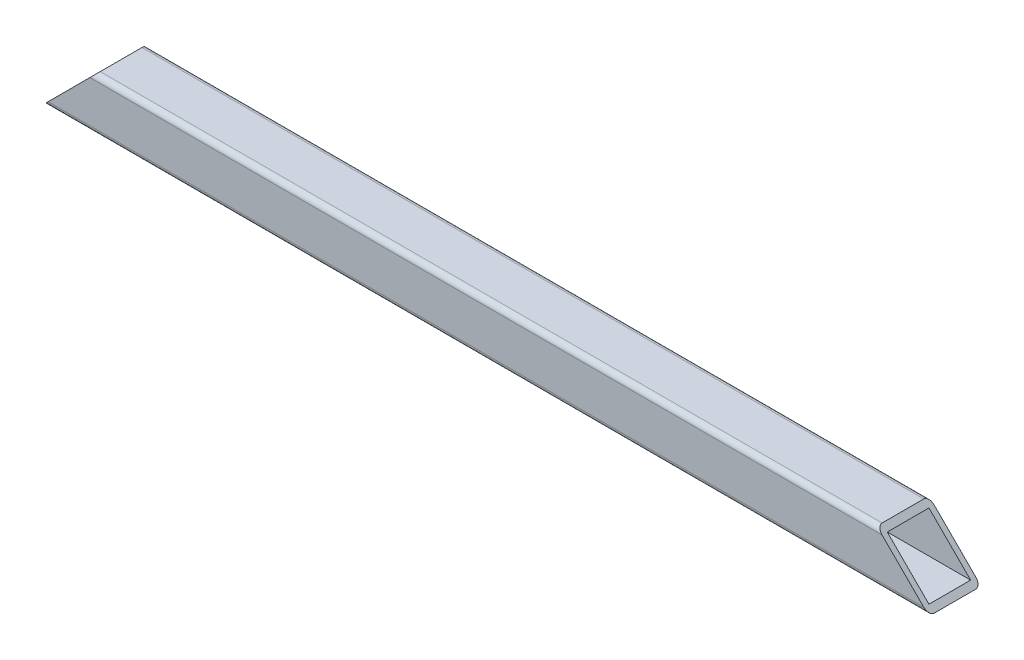
ISO-10303-21;
HEADER;
FILE_DESCRIPTION(('STEP AP214'),'2;1');
FILE_NAME('part.step','',(''),(''),'','','');
FILE_SCHEMA(('AUTOMOTIVE_DESIGN { 1 0 10303 214 1 1 1 1 }'));
ENDSEC;
DATA;
#1=APPLICATION_CONTEXT('core data for automotive mechanical design processes');
#2=APPLICATION_PROTOCOL_DEFINITION('international standard','automotive_design',2000,#1);
#3=PRODUCT_CONTEXT('',#1,'mechanical');
#4=PRODUCT('Part','Part','',(#3));
#5=PRODUCT_RELATED_PRODUCT_CATEGORY('part','',(#4));
#6=PRODUCT_DEFINITION_FORMATION('','',#4);
#7=PRODUCT_DEFINITION_CONTEXT('part definition',#1,'design');
#8=PRODUCT_DEFINITION('design','',#6,#7);
#9=PRODUCT_DEFINITION_SHAPE('','',#8);
#10=(LENGTH_UNIT() NAMED_UNIT(*) SI_UNIT(.MILLI.,.METRE.));
#11=(NAMED_UNIT(*) PLANE_ANGLE_UNIT() SI_UNIT($,.RADIAN.));
#12=(NAMED_UNIT(*) SI_UNIT($,.STERADIAN.) SOLID_ANGLE_UNIT());
#13=UNCERTAINTY_MEASURE_WITH_UNIT(LENGTH_MEASURE(1.E-05),#10,'distance_accuracy_value','');
#14=(GEOMETRIC_REPRESENTATION_CONTEXT(3) GLOBAL_UNCERTAINTY_ASSIGNED_CONTEXT((#13)) GLOBAL_UNIT_ASSIGNED_CONTEXT((#10,
#11,#12)) REPRESENTATION_CONTEXT('',''));
#15=CARTESIAN_POINT('',(0.,0.,0.));
#16=DIRECTION('',(0.,0.,1.));
#17=DIRECTION('',(1.,0.,0.));
#18=AXIS2_PLACEMENT_3D('',#15,#16,#17);
#19=CARTESIAN_POINT('',(-269.900000000001,-1100.,-20.));
#20=DIRECTION('',(0.,-1.,0.));
#21=DIRECTION('',(0.,0.,-1.));
#22=AXIS2_PLACEMENT_3D('',#19,#20,#21);
#23=PLANE('',#22);
#24=DIRECTION('',(0.,0.,1.));
#25=VECTOR('',#24,1.);
#26=CARTESIAN_POINT('',(-610.100000000001,-1100.,-20.));
#27=LINE('',#26,#25);
#28=CARTESIAN_POINT('',(-610.100000000001,-1100.,-18.));
#29=VERTEX_POINT('',#28);
#30=CARTESIAN_POINT('',(-610.100000000001,-1100.,-2.));
#31=VERTEX_POINT('',#30);
#32=EDGE_CURVE('E197',#29,#31,#27,.T.);
#33=ORIENTED_EDGE('',*,*,#32,.F.);
#34=DIRECTION('',(1.,0.,0.));
#35=VECTOR('',#34,1.);
#36=CARTESIAN_POINT('',(-269.900000000001,-1100.,-18.));
#37=LINE('',#36,#35);
#38=CARTESIAN_POINT('',(-269.900000000001,-1100.,-18.));
#39=VERTEX_POINT('',#38);
#40=EDGE_CURVE('E224',#29,#39,#37,.T.);
#41=ORIENTED_EDGE('',*,*,#40,.T.);
#42=DIRECTION('',(0.,0.,1.));
#43=VECTOR('',#42,1.);
#44=CARTESIAN_POINT('',(-269.900000000001,-1100.,-20.));
#45=LINE('',#44,#43);
#46=CARTESIAN_POINT('',(-269.900000000001,-1100.,-2.));
#47=VERTEX_POINT('',#46);
#48=EDGE_CURVE('E198',#39,#47,#45,.T.);
#49=ORIENTED_EDGE('',*,*,#48,.T.);
#50=DIRECTION('',(1.,0.,0.));
#51=VECTOR('',#50,1.);
#52=CARTESIAN_POINT('',(-269.900000000001,-1100.,-2.));
#53=LINE('',#52,#51);
#54=EDGE_CURVE('E220',#47,#31,#53,.F.);
#55=ORIENTED_EDGE('',*,*,#54,.T.);
#56=EDGE_LOOP('',(#33,#41,#49,#55));
#57=FACE_BOUND('',#56,.T.);
#58=ADVANCED_FACE('F44',(#57),#23,.T.);
#59=CARTESIAN_POINT('',(-269.900000000001,-1080.,-20.));
#60=DIRECTION('',(0.,1.,0.));
#61=DIRECTION('',(0.,0.,1.));
#62=AXIS2_PLACEMENT_3D('',#59,#60,#61);
#63=PLANE('',#62);
#64=DIRECTION('',(0.,0.,1.));
#65=VECTOR('',#64,1.);
#66=CARTESIAN_POINT('',(-289.900000000001,-1080.,-20.));
#67=LINE('',#66,#65);
#68=CARTESIAN_POINT('',(-289.900000000001,-1080.,-18.));
#69=VERTEX_POINT('',#68);
#70=CARTESIAN_POINT('',(-289.900000000001,-1080.,-2.));
#71=VERTEX_POINT('',#70);
#72=EDGE_CURVE('E166',#69,#71,#67,.T.);
#73=ORIENTED_EDGE('',*,*,#72,.F.);
#74=DIRECTION('',(-1.,0.,0.));
#75=VECTOR('',#74,1.);
#76=CARTESIAN_POINT('',(-610.100000000001,-1080.,-18.));
#77=LINE('',#76,#75);
#78=CARTESIAN_POINT('',(-590.100000000001,-1080.,-18.));
#79=VERTEX_POINT('',#78);
#80=EDGE_CURVE('E208',#69,#79,#77,.T.);
#81=ORIENTED_EDGE('',*,*,#80,.T.);
#82=DIRECTION('',(0.,0.,1.));
#83=VECTOR('',#82,1.);
#84=CARTESIAN_POINT('',(-590.100000000001,-1080.,-20.));
#85=LINE('',#84,#83);
#86=CARTESIAN_POINT('',(-590.100000000001,-1080.,-2.));
#87=VERTEX_POINT('',#86);
#88=EDGE_CURVE('E170',#79,#87,#85,.T.);
#89=ORIENTED_EDGE('',*,*,#88,.T.);
#90=DIRECTION('',(-1.,0.,0.));
#91=VECTOR('',#90,1.);
#92=CARTESIAN_POINT('',(-269.900000000001,-1080.,-2.));
#93=LINE('',#92,#91);
#94=EDGE_CURVE('E202',#87,#71,#93,.F.);
#95=ORIENTED_EDGE('',*,*,#94,.T.);
#96=EDGE_LOOP('',(#73,#81,#89,#95));
#97=FACE_BOUND('',#96,.T.);
#98=ADVANCED_FACE('F276',(#97),#63,.T.);
#99=CARTESIAN_POINT('',(0.,0.,-20.));
#100=DIRECTION('',(0.,0.,1.));
#101=DIRECTION('',(1.,0.,0.));
#102=AXIS2_PLACEMENT_3D('',#99,#100,#101);
#103=PLANE('',#102);
#104=DIRECTION('',(-1.,0.,0.));
#105=VECTOR('',#104,1.);
#106=CARTESIAN_POINT('',(-269.900000000001,-1082.,-20.));
#107=LINE('',#106,#105);
#108=CARTESIAN_POINT('',(-592.100000000001,-1082.,-20.));
#109=VERTEX_POINT('',#108);
#110=CARTESIAN_POINT('',(-287.900000000001,-1082.,-20.));
#111=VERTEX_POINT('',#110);
#112=EDGE_CURVE('E216',#109,#111,#107,.F.);
#113=ORIENTED_EDGE('',*,*,#112,.T.);
#114=DIRECTION('',(0.707106781186544,-0.707106781186551,0.));
#115=VECTOR('',#114,1.);
#116=CARTESIAN_POINT('',(-289.900000000001,-1080.,-20.));
#117=LINE('',#116,#115);
#118=CARTESIAN_POINT('',(-271.900000000001,-1098.,-20.));
#119=VERTEX_POINT('',#118);
#120=EDGE_CURVE('E162',#111,#119,#117,.T.);
#121=ORIENTED_EDGE('',*,*,#120,.T.);
#122=DIRECTION('',(1.,0.,0.));
#123=VECTOR('',#122,1.);
#124=CARTESIAN_POINT('',(-610.100000000001,-1098.,-20.));
#125=LINE('',#124,#123);
#126=CARTESIAN_POINT('',(-608.100000000001,-1098.,-20.));
#127=VERTEX_POINT('',#126);
#128=EDGE_CURVE('E212',#119,#127,#125,.F.);
#129=ORIENTED_EDGE('',*,*,#128,.T.);
#130=DIRECTION('',(0.707106781186544,0.707106781186551,0.));
#131=VECTOR('',#130,1.);
#132=CARTESIAN_POINT('',(-610.100000000001,-1100.,-20.));
#133=LINE('',#132,#131);
#134=EDGE_CURVE('E157',#127,#109,#133,.T.);
#135=ORIENTED_EDGE('',*,*,#134,.T.);
#136=EDGE_LOOP('',(#113,#121,#129,#135));
#137=FACE_BOUND('',#136,.T.);
#138=ADVANCED_FACE('F282',(#137),#103,.F.);
#139=CARTESIAN_POINT('',(0.,0.,0.));
#140=DIRECTION('',(0.,0.,1.));
#141=DIRECTION('',(1.,0.,0.));
#142=AXIS2_PLACEMENT_3D('',#139,#140,#141);
#143=PLANE('',#142);
#144=DIRECTION('',(0.707106781186544,-0.707106781186551,0.));
#145=VECTOR('',#144,1.);
#146=CARTESIAN_POINT('',(-289.900000000001,-1080.,0.));
#147=LINE('',#146,#145);
#148=CARTESIAN_POINT('',(-287.900000000001,-1082.,0.));
#149=VERTEX_POINT('',#148);
#150=CARTESIAN_POINT('',(-271.900000000001,-1098.,0.));
#151=VERTEX_POINT('',#150);
#152=EDGE_CURVE('E167',#149,#151,#147,.T.);
#153=ORIENTED_EDGE('',*,*,#152,.F.);
#154=DIRECTION('',(-1.,0.,0.));
#155=VECTOR('',#154,1.);
#156=CARTESIAN_POINT('',(0.,-1082.,0.));
#157=LINE('',#156,#155);
#158=CARTESIAN_POINT('',(-592.100000000001,-1082.,0.));
#159=VERTEX_POINT('',#158);
#160=EDGE_CURVE('E232',#149,#159,#157,.T.);
#161=ORIENTED_EDGE('',*,*,#160,.T.);
#162=DIRECTION('',(0.707106781186544,0.707106781186551,0.));
#163=VECTOR('',#162,1.);
#164=CARTESIAN_POINT('',(-610.100000000001,-1100.,0.));
#165=LINE('',#164,#163);
#166=CARTESIAN_POINT('',(-608.100000000001,-1098.,0.));
#167=VERTEX_POINT('',#166);
#168=EDGE_CURVE('E153',#167,#159,#165,.T.);
#169=ORIENTED_EDGE('',*,*,#168,.F.);
#170=DIRECTION('',(1.,0.,0.));
#171=VECTOR('',#170,1.);
#172=CARTESIAN_POINT('',(0.,-1098.,0.));
#173=LINE('',#172,#171);
#174=EDGE_CURVE('E228',#167,#151,#173,.T.);
#175=ORIENTED_EDGE('',*,*,#174,.T.);
#176=EDGE_LOOP('',(#153,#161,#169,#175));
#177=FACE_BOUND('',#176,.T.);
#178=ADVANCED_FACE('F287',(#177),#143,.T.);
#179=CARTESIAN_POINT('',(-269.900000000001,-1082.,-18.));
#180=DIRECTION('',(1.,0.,0.));
#181=DIRECTION('',(0.,0.,-1.));
#182=AXIS2_PLACEMENT_3D('',#179,#180,#181);
#183=CYLINDRICAL_SURFACE('',#182,2.);
#184=CARTESIAN_POINT('',(-287.900000000001,-1082.,-18.));
#185=DIRECTION('',(-0.707106781186551,-0.707106781186544,0.));
#186=DIRECTION('',(0.707106781186544,-0.707106781186551,0.));
#187=AXIS2_PLACEMENT_3D('',#184,#185,#186);
#188=ELLIPSE('',#187,2.82842712474617,2.);
#189=EDGE_CURVE('E194',#111,#69,#188,.F.);
#190=ORIENTED_EDGE('',*,*,#189,.F.);
#191=ORIENTED_EDGE('',*,*,#112,.F.);
#192=CARTESIAN_POINT('',(-592.100000000001,-1082.,-18.));
#193=DIRECTION('',(0.707106781186551,-0.707106781186544,0.));
#194=DIRECTION('',(0.707106781186544,0.707106781186551,0.));
#195=AXIS2_PLACEMENT_3D('',#192,#193,#194);
#196=ELLIPSE('',#195,2.82842712474617,2.);
#197=EDGE_CURVE('E185',#79,#109,#196,.F.);
#198=ORIENTED_EDGE('',*,*,#197,.F.);
#199=ORIENTED_EDGE('',*,*,#80,.F.);
#200=EDGE_LOOP('',(#190,#191,#198,#199));
#201=FACE_BOUND('',#200,.T.);
#202=ADVANCED_FACE('F290',(#201),#183,.T.);
#203=CARTESIAN_POINT('',(-269.900000000001,-1098.,-18.));
#204=DIRECTION('',(-1.,0.,0.));
#205=DIRECTION('',(0.,0.,1.));
#206=AXIS2_PLACEMENT_3D('',#203,#204,#205);
#207=CYLINDRICAL_SURFACE('',#206,2.);
#208=CARTESIAN_POINT('',(-271.900000000001,-1098.,-18.));
#209=DIRECTION('',(-0.707106781186551,-0.707106781186544,0.));
#210=DIRECTION('',(-0.707106781186544,0.707106781186551,0.));
#211=AXIS2_PLACEMENT_3D('',#208,#209,#210);
#212=ELLIPSE('',#211,2.82842712474617,2.);
#213=EDGE_CURVE('E191',#39,#119,#212,.F.);
#214=ORIENTED_EDGE('',*,*,#213,.F.);
#215=ORIENTED_EDGE('',*,*,#40,.F.);
#216=CARTESIAN_POINT('',(-608.100000000001,-1098.,-18.));
#217=DIRECTION('',(0.707106781186551,-0.707106781186544,0.));
#218=DIRECTION('',(-0.707106781186544,-0.707106781186551,0.));
#219=AXIS2_PLACEMENT_3D('',#216,#217,#218);
#220=ELLIPSE('',#219,2.82842712474617,2.);
#221=EDGE_CURVE('E182',#127,#29,#220,.F.);
#222=ORIENTED_EDGE('',*,*,#221,.F.);
#223=ORIENTED_EDGE('',*,*,#128,.F.);
#224=EDGE_LOOP('',(#214,#215,#222,#223));
#225=FACE_BOUND('',#224,.T.);
#226=ADVANCED_FACE('F293',(#225),#207,.T.);
#227=CARTESIAN_POINT('',(0.,-1082.,-2.));
#228=DIRECTION('',(-1.,0.,0.));
#229=DIRECTION('',(0.,0.,1.));
#230=AXIS2_PLACEMENT_3D('',#227,#228,#229);
#231=CYLINDRICAL_SURFACE('',#230,2.);
#232=CARTESIAN_POINT('',(-287.900000000001,-1082.,-2.));
#233=DIRECTION('',(-0.707106781186551,-0.707106781186544,0.));
#234=DIRECTION('',(-0.707106781186544,0.707106781186551,0.));
#235=AXIS2_PLACEMENT_3D('',#232,#233,#234);
#236=ELLIPSE('',#235,2.82842712474617,2.);
#237=EDGE_CURVE('E188',#71,#149,#236,.F.);
#238=ORIENTED_EDGE('',*,*,#237,.F.);
#239=ORIENTED_EDGE('',*,*,#94,.F.);
#240=CARTESIAN_POINT('',(-592.100000000001,-1082.,-2.));
#241=DIRECTION('',(0.707106781186551,-0.707106781186544,0.));
#242=DIRECTION('',(-0.707106781186544,-0.707106781186551,0.));
#243=AXIS2_PLACEMENT_3D('',#240,#241,#242);
#244=ELLIPSE('',#243,2.82842712474617,2.);
#245=EDGE_CURVE('E173',#159,#87,#244,.F.);
#246=ORIENTED_EDGE('',*,*,#245,.F.);
#247=ORIENTED_EDGE('',*,*,#160,.F.);
#248=EDGE_LOOP('',(#238,#239,#246,#247));
#249=FACE_BOUND('',#248,.T.);
#250=ADVANCED_FACE('F296',(#249),#231,.T.);
#251=CARTESIAN_POINT('',(0.,-1098.,-2.));
#252=DIRECTION('',(1.,0.,0.));
#253=DIRECTION('',(0.,0.,-1.));
#254=AXIS2_PLACEMENT_3D('',#251,#252,#253);
#255=CYLINDRICAL_SURFACE('',#254,2.);
#256=CARTESIAN_POINT('',(-271.900000000001,-1098.,-2.));
#257=DIRECTION('',(-0.707106781186551,-0.707106781186544,0.));
#258=DIRECTION('',(0.707106781186544,-0.707106781186551,0.));
#259=AXIS2_PLACEMENT_3D('',#256,#257,#258);
#260=ELLIPSE('',#259,2.82842712474617,2.);
#261=EDGE_CURVE('E239',#151,#47,#260,.F.);
#262=ORIENTED_EDGE('',*,*,#261,.F.);
#263=ORIENTED_EDGE('',*,*,#174,.F.);
#264=CARTESIAN_POINT('',(-608.100000000001,-1098.,-2.));
#265=DIRECTION('',(0.707106781186551,-0.707106781186544,0.));
#266=DIRECTION('',(0.707106781186544,0.707106781186551,0.));
#267=AXIS2_PLACEMENT_3D('',#264,#265,#266);
#268=ELLIPSE('',#267,2.82842712474617,2.);
#269=EDGE_CURVE('E236',#31,#167,#268,.F.);
#270=ORIENTED_EDGE('',*,*,#269,.F.);
#271=ORIENTED_EDGE('',*,*,#54,.F.);
#272=EDGE_LOOP('',(#262,#263,#270,#271));
#273=FACE_BOUND('',#272,.T.);
#274=ADVANCED_FACE('F46',(#273),#255,.T.);
#275=CARTESIAN_POINT('',(-610.100000000001,-1100.,-20.));
#276=DIRECTION('',(0.707106781186551,-0.707106781186544,0.));
#277=DIRECTION('',(0.707106781186544,0.707106781186551,0.));
#278=AXIS2_PLACEMENT_3D('',#275,#276,#277);
#279=PLANE('',#278);
#280=DIRECTION('',(0.,0.,-1.));
#281=VECTOR('',#280,1.);
#282=CARTESIAN_POINT('',(-608.100000000001,-1098.,-20.));
#283=LINE('',#282,#281);
#284=CARTESIAN_POINT('',(-608.100000000001,-1098.,-2.));
#285=VERTEX_POINT('',#284);
#286=CARTESIAN_POINT('',(-608.100000000001,-1098.,-18.));
#287=VERTEX_POINT('',#286);
#288=EDGE_CURVE('E151',#285,#287,#283,.T.);
#289=ORIENTED_EDGE('',*,*,#288,.T.);
#290=DIRECTION('',(0.707106781186544,0.707106781186551,0.));
#291=VECTOR('',#290,1.);
#292=CARTESIAN_POINT('',(-610.100000000001,-1100.,-18.));
#293=LINE('',#292,#291);
#294=CARTESIAN_POINT('',(-592.100000000001,-1082.,-18.));
#295=VERTEX_POINT('',#294);
#296=EDGE_CURVE('E143',#287,#295,#293,.T.);
#297=ORIENTED_EDGE('',*,*,#296,.T.);
#298=DIRECTION('',(0.,0.,1.));
#299=VECTOR('',#298,1.);
#300=CARTESIAN_POINT('',(-592.100000000001,-1082.,-20.));
#301=LINE('',#300,#299);
#302=CARTESIAN_POINT('',(-592.100000000001,-1082.,-2.));
#303=VERTEX_POINT('',#302);
#304=EDGE_CURVE('E131',#295,#303,#301,.T.);
#305=ORIENTED_EDGE('',*,*,#304,.T.);
#306=DIRECTION('',(-0.707106781186544,-0.707106781186551,0.));
#307=VECTOR('',#306,1.);
#308=CARTESIAN_POINT('',(-610.100000000001,-1100.,-2.));
#309=LINE('',#308,#307);
#310=EDGE_CURVE('E137',#303,#285,#309,.T.);
#311=ORIENTED_EDGE('',*,*,#310,.T.);
#312=EDGE_LOOP('',(#289,#297,#305,#311));
#313=FACE_BOUND('',#312,.T.);
#314=ORIENTED_EDGE('',*,*,#197,.T.);
#315=ORIENTED_EDGE('',*,*,#134,.F.);
#316=ORIENTED_EDGE('',*,*,#221,.T.);
#317=ORIENTED_EDGE('',*,*,#32,.T.);
#318=ORIENTED_EDGE('',*,*,#269,.T.);
#319=ORIENTED_EDGE('',*,*,#168,.T.);
#320=ORIENTED_EDGE('',*,*,#245,.T.);
#321=ORIENTED_EDGE('',*,*,#88,.F.);
#322=EDGE_LOOP('',(#314,#315,#316,#317,#318,#319,#320,#321));
#323=FACE_BOUND('',#322,.T.);
#324=ADVANCED_FACE('F149',(#313,#323),#279,.F.);
#325=CARTESIAN_POINT('',(-289.900000000001,-1080.,-20.));
#326=DIRECTION('',(-0.707106781186551,-0.707106781186544,0.));
#327=DIRECTION('',(0.707106781186544,-0.707106781186551,0.));
#328=AXIS2_PLACEMENT_3D('',#325,#326,#327);
#329=PLANE('',#328);
#330=DIRECTION('',(0.,0.,-1.));
#331=VECTOR('',#330,1.);
#332=CARTESIAN_POINT('',(-287.900000000001,-1082.,-20.));
#333=LINE('',#332,#331);
#334=CARTESIAN_POINT('',(-287.900000000001,-1082.,-2.));
#335=VERTEX_POINT('',#334);
#336=CARTESIAN_POINT('',(-287.900000000001,-1082.,-18.));
#337=VERTEX_POINT('',#336);
#338=EDGE_CURVE('E242',#335,#337,#333,.T.);
#339=ORIENTED_EDGE('',*,*,#338,.T.);
#340=DIRECTION('',(0.707106781186544,-0.707106781186551,0.));
#341=VECTOR('',#340,1.);
#342=CARTESIAN_POINT('',(-289.900000000001,-1080.,-18.));
#343=LINE('',#342,#341);
#344=CARTESIAN_POINT('',(-271.900000000001,-1098.,-18.));
#345=VERTEX_POINT('',#344);
#346=EDGE_CURVE('E11',#337,#345,#343,.T.);
#347=ORIENTED_EDGE('',*,*,#346,.T.);
#348=DIRECTION('',(0.,0.,1.));
#349=VECTOR('',#348,1.);
#350=CARTESIAN_POINT('',(-271.900000000001,-1098.,-20.));
#351=LINE('',#350,#349);
#352=CARTESIAN_POINT('',(-271.900000000001,-1098.,-2.));
#353=VERTEX_POINT('',#352);
#354=EDGE_CURVE('E53',#345,#353,#351,.T.);
#355=ORIENTED_EDGE('',*,*,#354,.T.);
#356=DIRECTION('',(-0.707106781186544,0.707106781186551,0.));
#357=VECTOR('',#356,1.);
#358=CARTESIAN_POINT('',(-289.900000000001,-1080.,-2.));
#359=LINE('',#358,#357);
#360=EDGE_CURVE('E245',#353,#335,#359,.T.);
#361=ORIENTED_EDGE('',*,*,#360,.T.);
#362=EDGE_LOOP('',(#339,#347,#355,#361));
#363=FACE_BOUND('',#362,.T.);
#364=ORIENTED_EDGE('',*,*,#189,.T.);
#365=ORIENTED_EDGE('',*,*,#72,.T.);
#366=ORIENTED_EDGE('',*,*,#237,.T.);
#367=ORIENTED_EDGE('',*,*,#152,.T.);
#368=ORIENTED_EDGE('',*,*,#261,.T.);
#369=ORIENTED_EDGE('',*,*,#48,.F.);
#370=ORIENTED_EDGE('',*,*,#213,.T.);
#371=ORIENTED_EDGE('',*,*,#120,.F.);
#372=EDGE_LOOP('',(#364,#365,#366,#367,#368,#369,#370,#371));
#373=FACE_BOUND('',#372,.T.);
#374=ADVANCED_FACE('F251',(#363,#373),#329,.F.);
#375=CARTESIAN_POINT('',(-610.100000000001,-1098.,-18.));
#376=DIRECTION('',(0.,0.,-1.));
#377=DIRECTION('',(-1.,0.,0.));
#378=AXIS2_PLACEMENT_3D('',#375,#376,#377);
#379=PLANE('',#378);
#380=DIRECTION('',(1.,0.,0.));
#381=VECTOR('',#380,1.);
#382=CARTESIAN_POINT('',(-610.100000000001,-1098.,-18.));
#383=LINE('',#382,#381);
#384=EDGE_CURVE('E138',#287,#345,#383,.T.);
#385=ORIENTED_EDGE('',*,*,#384,.T.);
#386=ORIENTED_EDGE('',*,*,#346,.F.);
#387=DIRECTION('',(1.,0.,0.));
#388=VECTOR('',#387,1.);
#389=CARTESIAN_POINT('',(-610.100000000001,-1082.,-18.));
#390=LINE('',#389,#388);
#391=EDGE_CURVE('E65',#295,#337,#390,.T.);
#392=ORIENTED_EDGE('',*,*,#391,.F.);
#393=ORIENTED_EDGE('',*,*,#296,.F.);
#394=EDGE_LOOP('',(#385,#386,#392,#393));
#395=FACE_BOUND('',#394,.T.);
#396=ADVANCED_FACE('F142',(#395),#379,.F.);
#397=CARTESIAN_POINT('',(-610.100000000001,-1098.,-2.));
#398=DIRECTION('',(0.,-1.,0.));
#399=DIRECTION('',(0.,0.,-1.));
#400=AXIS2_PLACEMENT_3D('',#397,#398,#399);
#401=PLANE('',#400);
#402=DIRECTION('',(1.,0.,0.));
#403=VECTOR('',#402,1.);
#404=CARTESIAN_POINT('',(-610.100000000001,-1098.,-2.));
#405=LINE('',#404,#403);
#406=EDGE_CURVE('E257',#285,#353,#405,.T.);
#407=ORIENTED_EDGE('',*,*,#406,.T.);
#408=ORIENTED_EDGE('',*,*,#354,.F.);
#409=ORIENTED_EDGE('',*,*,#384,.F.);
#410=ORIENTED_EDGE('',*,*,#288,.F.);
#411=EDGE_LOOP('',(#407,#408,#409,#410));
#412=FACE_BOUND('',#411,.T.);
#413=ADVANCED_FACE('F255',(#412),#401,.F.);
#414=CARTESIAN_POINT('',(-610.100000000001,-1082.,-2.));
#415=DIRECTION('',(0.,0.,1.));
#416=DIRECTION('',(1.,0.,0.));
#417=AXIS2_PLACEMENT_3D('',#414,#415,#416);
#418=PLANE('',#417);
#419=DIRECTION('',(1.,0.,0.));
#420=VECTOR('',#419,1.);
#421=CARTESIAN_POINT('',(-610.100000000001,-1082.,-2.));
#422=LINE('',#421,#420);
#423=EDGE_CURVE('E60',#303,#335,#422,.T.);
#424=ORIENTED_EDGE('',*,*,#423,.T.);
#425=ORIENTED_EDGE('',*,*,#360,.F.);
#426=ORIENTED_EDGE('',*,*,#406,.F.);
#427=ORIENTED_EDGE('',*,*,#310,.F.);
#428=EDGE_LOOP('',(#424,#425,#426,#427));
#429=FACE_BOUND('',#428,.T.);
#430=ADVANCED_FACE('F266',(#429),#418,.F.);
#431=CARTESIAN_POINT('',(-610.100000000001,-1082.,-18.));
#432=DIRECTION('',(0.,1.,0.));
#433=DIRECTION('',(0.,0.,1.));
#434=AXIS2_PLACEMENT_3D('',#431,#432,#433);
#435=PLANE('',#434);
#436=ORIENTED_EDGE('',*,*,#391,.T.);
#437=ORIENTED_EDGE('',*,*,#338,.F.);
#438=ORIENTED_EDGE('',*,*,#423,.F.);
#439=ORIENTED_EDGE('',*,*,#304,.F.);
#440=EDGE_LOOP('',(#436,#437,#438,#439));
#441=FACE_BOUND('',#440,.T.);
#442=ADVANCED_FACE('F132',(#441),#435,.F.);
#443=CLOSED_SHELL('',(#58,#98,#138,#178,#202,#226,#250,#274,#324,#374,#396,#413,#430,#442));
#444=MANIFOLD_SOLID_BREP('B2',#443);
#445=ADVANCED_BREP_SHAPE_REPRESENTATION('',(#18,#444),#14);
#446=SHAPE_DEFINITION_REPRESENTATION(#9,#445);
ENDSEC;
END-ISO-10303-21;
